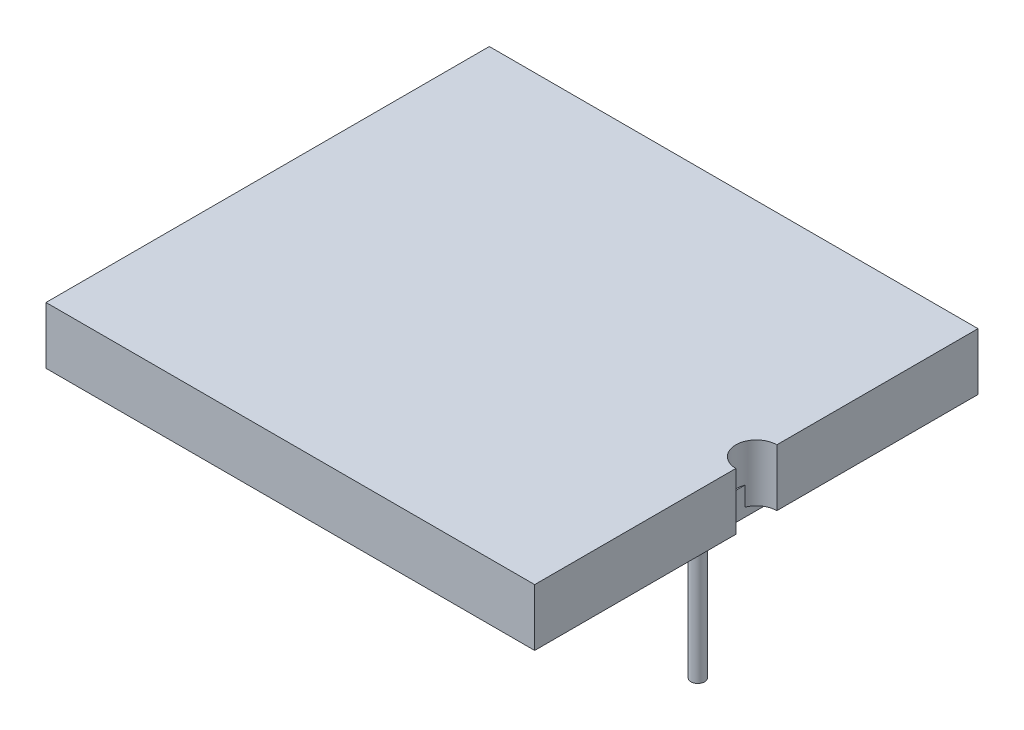
ISO-10303-21;
HEADER;
FILE_DESCRIPTION(('STEP AP214'),'2;1');
FILE_NAME('part.step','',(''),(''),'','','');
FILE_SCHEMA(('AUTOMOTIVE_DESIGN { 1 0 10303 214 1 1 1 1 }'));
ENDSEC;
DATA;
#1=APPLICATION_CONTEXT('core data for automotive mechanical design processes');
#2=APPLICATION_PROTOCOL_DEFINITION('international standard','automotive_design',2000,#1);
#3=PRODUCT_CONTEXT('',#1,'mechanical');
#4=PRODUCT('Part','Part','',(#3));
#5=PRODUCT_RELATED_PRODUCT_CATEGORY('part','',(#4));
#6=PRODUCT_DEFINITION_FORMATION('','',#4);
#7=PRODUCT_DEFINITION_CONTEXT('part definition',#1,'design');
#8=PRODUCT_DEFINITION('design','',#6,#7);
#9=PRODUCT_DEFINITION_SHAPE('','',#8);
#10=(LENGTH_UNIT() NAMED_UNIT(*) SI_UNIT(.MILLI.,.METRE.));
#11=(NAMED_UNIT(*) PLANE_ANGLE_UNIT() SI_UNIT($,.RADIAN.));
#12=(NAMED_UNIT(*) SI_UNIT($,.STERADIAN.) SOLID_ANGLE_UNIT());
#13=UNCERTAINTY_MEASURE_WITH_UNIT(LENGTH_MEASURE(1.E-05),#10,'distance_accuracy_value','');
#14=(GEOMETRIC_REPRESENTATION_CONTEXT(3) GLOBAL_UNCERTAINTY_ASSIGNED_CONTEXT((#13)) GLOBAL_UNIT_ASSIGNED_CONTEXT((#10,
#11,#12)) REPRESENTATION_CONTEXT('',''));
#15=CARTESIAN_POINT('',(0.,0.,0.));
#16=DIRECTION('',(0.,0.,1.));
#17=DIRECTION('',(1.,0.,0.));
#18=AXIS2_PLACEMENT_3D('',#15,#16,#17);
#19=CARTESIAN_POINT('',(6.35,-0.64130000972746,0.));
#20=DIRECTION('',(0.,-1.,0.));
#21=DIRECTION('',(0.,0.,-1.));
#22=AXIS2_PLACEMENT_3D('',#19,#20,#21);
#23=CYLINDRICAL_SURFACE('',#22,0.232885614944613);
#24=CARTESIAN_POINT('',(6.35,-1.3,0.));
#25=DIRECTION('',(0.,-1.,0.));
#26=DIRECTION('',(0.,0.,-1.));
#27=AXIS2_PLACEMENT_3D('',#24,#25,#26);
#28=CIRCLE('',#27,0.232885614944613);
#29=CARTESIAN_POINT('',(6.35,-1.3,-0.232885614944613));
#30=VERTEX_POINT('',#29);
#31=EDGE_CURVE('E11',#30,#30,#28,.F.);
#32=ORIENTED_EDGE('',*,*,#31,.F.);
#33=EDGE_LOOP('',(#32));
#34=FACE_BOUND('',#33,.T.);
#35=CARTESIAN_POINT('',(6.35,-7.55,0.));
#36=DIRECTION('',(0.,-1.,0.));
#37=DIRECTION('',(0.,0.,1.));
#38=AXIS2_PLACEMENT_3D('',#35,#36,#37);
#39=CIRCLE('',#38,0.232885614944613);
#40=CARTESIAN_POINT('',(6.35,-7.55,0.232885614944613));
#41=VERTEX_POINT('',#40);
#42=EDGE_CURVE('E47',#41,#41,#39,.T.);
#43=ORIENTED_EDGE('',*,*,#42,.F.);
#44=EDGE_LOOP('',(#43));
#45=FACE_BOUND('',#44,.T.);
#46=ADVANCED_FACE('F41',(#34,#45),#23,.T.);
#47=CARTESIAN_POINT('',(-5.,-1.3,-5.));
#48=DIRECTION('',(0.,-1.,0.));
#49=DIRECTION('',(0.,0.,-1.));
#50=AXIS2_PLACEMENT_3D('',#47,#48,#49);
#51=PLANE('',#50);
#52=ORIENTED_EDGE('',*,*,#31,.T.);
#53=EDGE_LOOP('',(#52));
#54=FACE_BOUND('',#53,.T.);
#55=ADVANCED_FACE('F56',(#54),#51,.F.);
#56=CARTESIAN_POINT('',(6.35,-7.55,0.));
#57=DIRECTION('',(0.,1.,0.));
#58=DIRECTION('',(0.,0.,1.));
#59=AXIS2_PLACEMENT_3D('',#56,#57,#58);
#60=PLANE('',#59);
#61=ORIENTED_EDGE('',*,*,#42,.T.);
#62=EDGE_LOOP('',(#61));
#63=FACE_BOUND('',#62,.T.);
#64=ADVANCED_FACE('F53',(#63),#60,.F.);
#65=CLOSED_SHELL('',(#46,#55,#64));
#66=MANIFOLD_SOLID_BREP('B2',#65);
#67=CARTESIAN_POINT('',(-6.35,-0.64130000972746,0.));
#68=DIRECTION('',(0.,-1.,0.));
#69=DIRECTION('',(0.,0.,-1.));
#70=AXIS2_PLACEMENT_3D('',#67,#68,#69);
#71=CYLINDRICAL_SURFACE('',#70,0.232885614944613);
#72=CARTESIAN_POINT('',(-6.35,-1.3,0.));
#73=DIRECTION('',(0.,-1.,0.));
#74=DIRECTION('',(0.,0.,-1.));
#75=AXIS2_PLACEMENT_3D('',#72,#73,#74);
#76=CIRCLE('',#75,0.232885614944613);
#77=CARTESIAN_POINT('',(-6.35,-1.3,-0.232885614944613));
#78=VERTEX_POINT('',#77);
#79=EDGE_CURVE('E40',#78,#78,#76,.F.);
#80=ORIENTED_EDGE('',*,*,#79,.F.);
#81=EDGE_LOOP('',(#80));
#82=FACE_BOUND('',#81,.T.);
#83=CARTESIAN_POINT('',(-6.35,-7.55,0.));
#84=DIRECTION('',(0.,-1.,0.));
#85=DIRECTION('',(0.,0.,-1.));
#86=AXIS2_PLACEMENT_3D('',#83,#84,#85);
#87=CIRCLE('',#86,0.232885614944613);
#88=CARTESIAN_POINT('',(-6.35,-7.55,-0.232885614944613));
#89=VERTEX_POINT('',#88);
#90=EDGE_CURVE('E97',#89,#89,#87,.T.);
#91=ORIENTED_EDGE('',*,*,#90,.F.);
#92=EDGE_LOOP('',(#91));
#93=FACE_BOUND('',#92,.T.);
#94=ADVANCED_FACE('F91',(#82,#93),#71,.T.);
#95=CARTESIAN_POINT('',(-5.,-1.3,-5.));
#96=DIRECTION('',(0.,-1.,0.));
#97=DIRECTION('',(0.,0.,-1.));
#98=AXIS2_PLACEMENT_3D('',#95,#96,#97);
#99=PLANE('',#98);
#100=ORIENTED_EDGE('',*,*,#79,.T.);
#101=EDGE_LOOP('',(#100));
#102=FACE_BOUND('',#101,.T.);
#103=ADVANCED_FACE('F106',(#102),#99,.F.);
#104=CARTESIAN_POINT('',(-6.35,-7.55,0.));
#105=DIRECTION('',(0.,-1.,0.));
#106=DIRECTION('',(0.,0.,-1.));
#107=AXIS2_PLACEMENT_3D('',#104,#105,#106);
#108=PLANE('',#107);
#109=ORIENTED_EDGE('',*,*,#90,.T.);
#110=EDGE_LOOP('',(#109));
#111=FACE_BOUND('',#110,.T.);
#112=ADVANCED_FACE('F103',(#111),#108,.T.);
#113=CLOSED_SHELL('',(#94,#103,#112));
#114=MANIFOLD_SOLID_BREP('B6',#113);
#115=CARTESIAN_POINT('',(-7.7,-2.25,7.));
#116=DIRECTION('',(0.,-1.,0.));
#117=DIRECTION('',(0.,0.,-1.));
#118=AXIS2_PLACEMENT_3D('',#115,#116,#117);
#119=PLANE('',#118);
#120=CARTESIAN_POINT('',(-6.35,-2.25,0.));
#121=DIRECTION('',(0.,-1.,0.));
#122=DIRECTION('',(0.,0.,-1.));
#123=AXIS2_PLACEMENT_3D('',#120,#121,#122);
#124=CIRCLE('',#123,0.500000000000001);
#125=CARTESIAN_POINT('',(-6.35,-2.25,-0.500000000000001));
#126=VERTEX_POINT('',#125);
#127=EDGE_CURVE('E200',#126,#126,#124,.T.);
#128=ORIENTED_EDGE('',*,*,#127,.F.);
#129=EDGE_LOOP('',(#128));
#130=FACE_BOUND('',#129,.T.);
#131=DIRECTION('',(0.,0.,-1.));
#132=VECTOR('',#131,1.);
#133=CARTESIAN_POINT('',(-7.7,-2.25,-7.));
#134=LINE('',#133,#132);
#135=CARTESIAN_POINT('',(-7.7,-2.25,7.));
#136=VERTEX_POINT('',#135);
#137=CARTESIAN_POINT('',(-7.7,-2.25,-7.));
#138=VERTEX_POINT('',#137);
#139=EDGE_CURVE('E181',#136,#138,#134,.T.);
#140=ORIENTED_EDGE('',*,*,#139,.T.);
#141=DIRECTION('',(1.,0.,0.));
#142=VECTOR('',#141,1.);
#143=CARTESIAN_POINT('',(7.7,-2.25,-7.));
#144=LINE('',#143,#142);
#145=CARTESIAN_POINT('',(7.7,-2.25,-7.));
#146=VERTEX_POINT('',#145);
#147=EDGE_CURVE('E186',#138,#146,#144,.T.);
#148=ORIENTED_EDGE('',*,*,#147,.T.);
#149=DIRECTION('',(0.,0.,1.));
#150=VECTOR('',#149,1.);
#151=CARTESIAN_POINT('',(7.7,-2.25,-7.));
#152=LINE('',#151,#150);
#153=CARTESIAN_POINT('',(7.7,-2.25,7.));
#154=VERTEX_POINT('',#153);
#155=EDGE_CURVE('E192',#146,#154,#152,.T.);
#156=ORIENTED_EDGE('',*,*,#155,.T.);
#157=DIRECTION('',(-1.,0.,0.));
#158=VECTOR('',#157,1.);
#159=CARTESIAN_POINT('',(7.7,-2.25,7.));
#160=LINE('',#159,#158);
#161=EDGE_CURVE('E184',#154,#136,#160,.T.);
#162=ORIENTED_EDGE('',*,*,#161,.T.);
#163=EDGE_LOOP('',(#140,#148,#156,#162));
#164=FACE_BOUND('',#163,.T.);
#165=CARTESIAN_POINT('',(6.35,-2.25,0.));
#166=DIRECTION('',(0.,-1.,0.));
#167=DIRECTION('',(0.,0.,1.));
#168=AXIS2_PLACEMENT_3D('',#165,#166,#167);
#169=CIRCLE('',#168,0.500000000000001);
#170=CARTESIAN_POINT('',(6.35,-2.25,0.500000000000001));
#171=VERTEX_POINT('',#170);
#172=EDGE_CURVE('E257',#171,#171,#169,.T.);
#173=ORIENTED_EDGE('',*,*,#172,.F.);
#174=EDGE_LOOP('',(#173));
#175=FACE_BOUND('',#174,.T.);
#176=ADVANCED_FACE('F142',(#130,#164,#175),#119,.T.);
#177=CARTESIAN_POINT('',(-7.7,19.9124962462459,-7.));
#178=DIRECTION('',(-1.,0.,0.));
#179=DIRECTION('',(0.,0.,1.));
#180=AXIS2_PLACEMENT_3D('',#177,#178,#179);
#181=PLANE('',#180);
#182=DIRECTION('',(0.,0.,1.));
#183=VECTOR('',#182,1.);
#184=CARTESIAN_POINT('',(-7.7,-1.3,-7.));
#185=LINE('',#184,#183);
#186=CARTESIAN_POINT('',(-7.7,-1.3,-7.));
#187=VERTEX_POINT('',#186);
#188=CARTESIAN_POINT('',(-7.7,-1.3,7.));
#189=VERTEX_POINT('',#188);
#190=EDGE_CURVE('E151',#187,#189,#185,.T.);
#191=ORIENTED_EDGE('',*,*,#190,.F.);
#192=DIRECTION('',(0.,-1.,0.));
#193=VECTOR('',#192,1.);
#194=CARTESIAN_POINT('',(-7.7,19.9124962462459,-7.));
#195=LINE('',#194,#193);
#196=EDGE_CURVE('E177',#187,#138,#195,.T.);
#197=ORIENTED_EDGE('',*,*,#196,.T.);
#198=ORIENTED_EDGE('',*,*,#139,.F.);
#199=DIRECTION('',(0.,-1.,0.));
#200=VECTOR('',#199,1.);
#201=CARTESIAN_POINT('',(-7.7,19.9124962462459,7.));
#202=LINE('',#201,#200);
#203=EDGE_CURVE('E209',#189,#136,#202,.T.);
#204=ORIENTED_EDGE('',*,*,#203,.F.);
#205=EDGE_LOOP('',(#191,#197,#198,#204));
#206=FACE_BOUND('',#205,.T.);
#207=ADVANCED_FACE('F144',(#206),#181,.T.);
#208=CARTESIAN_POINT('',(7.7,19.9124962462459,7.));
#209=DIRECTION('',(0.,0.,1.));
#210=DIRECTION('',(1.,0.,0.));
#211=AXIS2_PLACEMENT_3D('',#208,#209,#210);
#212=PLANE('',#211);
#213=DIRECTION('',(1.,0.,0.));
#214=VECTOR('',#213,1.);
#215=CARTESIAN_POINT('',(7.7,-1.3,7.));
#216=LINE('',#215,#214);
#217=CARTESIAN_POINT('',(7.7,-1.3,7.));
#218=VERTEX_POINT('',#217);
#219=EDGE_CURVE('E208',#189,#218,#216,.T.);
#220=ORIENTED_EDGE('',*,*,#219,.F.);
#221=ORIENTED_EDGE('',*,*,#203,.T.);
#222=ORIENTED_EDGE('',*,*,#161,.F.);
#223=DIRECTION('',(0.,-1.,0.));
#224=VECTOR('',#223,1.);
#225=CARTESIAN_POINT('',(7.7,19.9124962462459,7.));
#226=LINE('',#225,#224);
#227=EDGE_CURVE('E213',#218,#154,#226,.T.);
#228=ORIENTED_EDGE('',*,*,#227,.F.);
#229=EDGE_LOOP('',(#220,#221,#222,#228));
#230=FACE_BOUND('',#229,.T.);
#231=ADVANCED_FACE('F221',(#230),#212,.T.);
#232=CARTESIAN_POINT('',(7.7,19.9124962462459,-7.));
#233=DIRECTION('',(1.,0.,0.));
#234=DIRECTION('',(0.,0.,-1.));
#235=AXIS2_PLACEMENT_3D('',#232,#233,#234);
#236=PLANE('',#235);
#237=DIRECTION('',(0.,0.,-1.));
#238=VECTOR('',#237,1.);
#239=CARTESIAN_POINT('',(7.7,-1.3,-7.));
#240=LINE('',#239,#238);
#241=CARTESIAN_POINT('',(7.7,-1.3,-7.));
#242=VERTEX_POINT('',#241);
#243=EDGE_CURVE('E206',#218,#242,#240,.T.);
#244=ORIENTED_EDGE('',*,*,#243,.F.);
#245=ORIENTED_EDGE('',*,*,#227,.T.);
#246=ORIENTED_EDGE('',*,*,#155,.F.);
#247=DIRECTION('',(0.,-1.,0.));
#248=VECTOR('',#247,1.);
#249=CARTESIAN_POINT('',(7.7,19.9124962462459,-7.));
#250=LINE('',#249,#248);
#251=EDGE_CURVE('E183',#242,#146,#250,.T.);
#252=ORIENTED_EDGE('',*,*,#251,.F.);
#253=EDGE_LOOP('',(#244,#245,#246,#252));
#254=FACE_BOUND('',#253,.T.);
#255=ADVANCED_FACE('F218',(#254),#236,.T.);
#256=CARTESIAN_POINT('',(7.7,19.9124962462459,-7.));
#257=DIRECTION('',(0.,0.,-1.));
#258=DIRECTION('',(-1.,0.,0.));
#259=AXIS2_PLACEMENT_3D('',#256,#257,#258);
#260=PLANE('',#259);
#261=DIRECTION('',(-1.,0.,0.));
#262=VECTOR('',#261,1.);
#263=CARTESIAN_POINT('',(7.7,-1.3,-7.));
#264=LINE('',#263,#262);
#265=EDGE_CURVE('E89',#242,#187,#264,.T.);
#266=ORIENTED_EDGE('',*,*,#265,.F.);
#267=ORIENTED_EDGE('',*,*,#251,.T.);
#268=ORIENTED_EDGE('',*,*,#147,.F.);
#269=ORIENTED_EDGE('',*,*,#196,.F.);
#270=EDGE_LOOP('',(#266,#267,#268,#269));
#271=FACE_BOUND('',#270,.T.);
#272=ADVANCED_FACE('F187',(#271),#260,.T.);
#273=CARTESIAN_POINT('',(-5.,-1.3,-5.));
#274=DIRECTION('',(0.,-1.,0.));
#275=DIRECTION('',(0.,0.,-1.));
#276=AXIS2_PLACEMENT_3D('',#273,#274,#275);
#277=PLANE('',#276);
#278=ORIENTED_EDGE('',*,*,#190,.T.);
#279=ORIENTED_EDGE('',*,*,#219,.T.);
#280=ORIENTED_EDGE('',*,*,#243,.T.);
#281=ORIENTED_EDGE('',*,*,#265,.T.);
#282=EDGE_LOOP('',(#278,#279,#280,#281));
#283=FACE_BOUND('',#282,.T.);
#284=ADVANCED_FACE('F222',(#283),#277,.F.);
#285=CARTESIAN_POINT('',(-6.35,-2.25,0.));
#286=DIRECTION('',(0.,1.,0.));
#287=DIRECTION('',(0.,0.,-1.));
#288=AXIS2_PLACEMENT_3D('',#285,#286,#287);
#289=CONICAL_SURFACE('',#288,0.500000000000001,0.715584993317677);
#290=CARTESIAN_POINT('',(-6.35,-2.55,0.));
#291=DIRECTION('',(0.,-1.,0.));
#292=DIRECTION('',(0.,0.,-1.));
#293=AXIS2_PLACEMENT_3D('',#290,#291,#292);
#294=CIRCLE('',#293,0.239213978655132);
#295=CARTESIAN_POINT('',(-6.35,-2.55,-0.239213978655132));
#296=VERTEX_POINT('',#295);
#297=EDGE_CURVE('E197',#296,#296,#294,.T.);
#298=ORIENTED_EDGE('',*,*,#297,.F.);
#299=EDGE_LOOP('',(#298));
#300=FACE_BOUND('',#299,.T.);
#301=ORIENTED_EDGE('',*,*,#127,.T.);
#302=EDGE_LOOP('',(#301));
#303=FACE_BOUND('',#302,.T.);
#304=ADVANCED_FACE('F224',(#300,#303),#289,.T.);
#305=CARTESIAN_POINT('',(-6.35,-2.55,0.));
#306=DIRECTION('',(0.,-1.,0.));
#307=DIRECTION('',(0.,0.,-1.));
#308=AXIS2_PLACEMENT_3D('',#305,#306,#307);
#309=PLANE('',#308);
#310=ORIENTED_EDGE('',*,*,#297,.T.);
#311=EDGE_LOOP('',(#310));
#312=FACE_BOUND('',#311,.T.);
#313=ADVANCED_FACE('F230',(#312),#309,.T.);
#314=CARTESIAN_POINT('',(6.35,-2.25,0.));
#315=DIRECTION('',(0.,1.,0.));
#316=DIRECTION('',(0.,0.,1.));
#317=AXIS2_PLACEMENT_3D('',#314,#315,#316);
#318=CONICAL_SURFACE('',#317,0.500000000000001,0.715584993317677);
#319=CARTESIAN_POINT('',(6.35,-2.55,0.));
#320=DIRECTION('',(0.,1.,0.));
#321=DIRECTION('',(0.,0.,1.));
#322=AXIS2_PLACEMENT_3D('',#319,#320,#321);
#323=CIRCLE('',#322,0.239213978655132);
#324=CARTESIAN_POINT('',(6.35,-2.55,0.239213978655132));
#325=VERTEX_POINT('',#324);
#326=EDGE_CURVE('E256',#325,#325,#323,.F.);
#327=ORIENTED_EDGE('',*,*,#326,.F.);
#328=EDGE_LOOP('',(#327));
#329=FACE_BOUND('',#328,.T.);
#330=ORIENTED_EDGE('',*,*,#172,.T.);
#331=EDGE_LOOP('',(#330));
#332=FACE_BOUND('',#331,.T.);
#333=ADVANCED_FACE('F244',(#329,#332),#318,.T.);
#334=CARTESIAN_POINT('',(6.35,-2.55,0.));
#335=DIRECTION('',(0.,1.,0.));
#336=DIRECTION('',(0.,0.,1.));
#337=AXIS2_PLACEMENT_3D('',#334,#335,#336);
#338=PLANE('',#337);
#339=ORIENTED_EDGE('',*,*,#326,.T.);
#340=EDGE_LOOP('',(#339));
#341=FACE_BOUND('',#340,.T.);
#342=ADVANCED_FACE('F248',(#341),#338,.F.);
#343=CLOSED_SHELL('',(#176,#207,#231,#255,#272,#284,#304,#313,#333,#342));
#344=MANIFOLD_SOLID_BREP('B35',#343);
#345=CARTESIAN_POINT('',(-5.,-0.9,0.));
#346=DIRECTION('',(-1.,0.,0.));
#347=DIRECTION('',(0.,0.,1.));
#348=AXIS2_PLACEMENT_3D('',#345,#346,#347);
#349=PLANE('',#348);
#350=DIRECTION('',(0.,0.,-1.));
#351=VECTOR('',#350,1.);
#352=CARTESIAN_POINT('',(-5.,-1.95,0.));
#353=LINE('',#352,#351);
#354=CARTESIAN_POINT('',(-5.,-1.95,5.));
#355=VERTEX_POINT('',#354);
#356=CARTESIAN_POINT('',(-5.,-1.95,-5.));
#357=VERTEX_POINT('',#356);
#358=EDGE_CURVE('E403',#355,#357,#353,.T.);
#359=ORIENTED_EDGE('',*,*,#358,.F.);
#360=DIRECTION('',(0.,-1.,0.));
#361=VECTOR('',#360,1.);
#362=CARTESIAN_POINT('',(-5.,-0.9,5.));
#363=LINE('',#362,#361);
#364=CARTESIAN_POINT('',(-5.,-0.9,5.));
#365=VERTEX_POINT('',#364);
#366=EDGE_CURVE('E140',#365,#355,#363,.T.);
#367=ORIENTED_EDGE('',*,*,#366,.F.);
#368=DIRECTION('',(0.,0.,-1.));
#369=VECTOR('',#368,1.);
#370=CARTESIAN_POINT('',(-5.,-0.9,0.));
#371=LINE('',#370,#369);
#372=CARTESIAN_POINT('',(-5.,-0.9,-5.));
#373=VERTEX_POINT('',#372);
#374=EDGE_CURVE('E397',#365,#373,#371,.T.);
#375=ORIENTED_EDGE('',*,*,#374,.T.);
#376=DIRECTION('',(0.,-1.,0.));
#377=VECTOR('',#376,1.);
#378=CARTESIAN_POINT('',(-5.,-0.9,-5.));
#379=LINE('',#378,#377);
#380=EDGE_CURVE('E342',#373,#357,#379,.T.);
#381=ORIENTED_EDGE('',*,*,#380,.T.);
#382=EDGE_LOOP('',(#359,#367,#375,#381));
#383=FACE_BOUND('',#382,.T.);
#384=ADVANCED_FACE('F339',(#383),#349,.T.);
#385=CARTESIAN_POINT('',(8.35,-0.9,5.));
#386=DIRECTION('',(0.,0.,1.));
#387=DIRECTION('',(1.,0.,0.));
#388=AXIS2_PLACEMENT_3D('',#385,#386,#387);
#389=PLANE('',#388);
#390=DIRECTION('',(-1.,0.,0.));
#391=VECTOR('',#390,1.);
#392=CARTESIAN_POINT('',(8.35,-1.95,5.));
#393=LINE('',#392,#391);
#394=CARTESIAN_POINT('',(5.,-1.95,5.));
#395=VERTEX_POINT('',#394);
#396=EDGE_CURVE('E399',#395,#355,#393,.T.);
#397=ORIENTED_EDGE('',*,*,#396,.F.);
#398=DIRECTION('',(0.,-1.,0.));
#399=VECTOR('',#398,1.);
#400=CARTESIAN_POINT('',(5.,-0.9,5.));
#401=LINE('',#400,#399);
#402=CARTESIAN_POINT('',(5.,-0.9,5.));
#403=VERTEX_POINT('',#402);
#404=EDGE_CURVE('E348',#403,#395,#401,.T.);
#405=ORIENTED_EDGE('',*,*,#404,.F.);
#406=DIRECTION('',(-1.,0.,0.));
#407=VECTOR('',#406,1.);
#408=CARTESIAN_POINT('',(8.35,-0.9,5.));
#409=LINE('',#408,#407);
#410=EDGE_CURVE('E394',#403,#365,#409,.T.);
#411=ORIENTED_EDGE('',*,*,#410,.T.);
#412=ORIENTED_EDGE('',*,*,#366,.T.);
#413=EDGE_LOOP('',(#397,#405,#411,#412));
#414=FACE_BOUND('',#413,.T.);
#415=ADVANCED_FACE('F413',(#414),#389,.T.);
#416=CARTESIAN_POINT('',(5.,-0.9,0.));
#417=DIRECTION('',(1.,0.,0.));
#418=DIRECTION('',(0.,0.,-1.));
#419=AXIS2_PLACEMENT_3D('',#416,#417,#418);
#420=PLANE('',#419);
#421=DIRECTION('',(0.,0.,1.));
#422=VECTOR('',#421,1.);
#423=CARTESIAN_POINT('',(5.,-1.95,0.));
#424=LINE('',#423,#422);
#425=CARTESIAN_POINT('',(5.,-1.95,-5.));
#426=VERTEX_POINT('',#425);
#427=EDGE_CURVE('E389',#426,#395,#424,.T.);
#428=ORIENTED_EDGE('',*,*,#427,.F.);
#429=DIRECTION('',(0.,-1.,0.));
#430=VECTOR('',#429,1.);
#431=CARTESIAN_POINT('',(5.,-0.9,-5.));
#432=LINE('',#431,#430);
#433=CARTESIAN_POINT('',(5.,-0.9,-5.));
#434=VERTEX_POINT('',#433);
#435=EDGE_CURVE('E384',#434,#426,#432,.T.);
#436=ORIENTED_EDGE('',*,*,#435,.F.);
#437=DIRECTION('',(0.,0.,1.));
#438=VECTOR('',#437,1.);
#439=CARTESIAN_POINT('',(5.,-0.9,0.));
#440=LINE('',#439,#438);
#441=EDGE_CURVE('E387',#434,#403,#440,.T.);
#442=ORIENTED_EDGE('',*,*,#441,.T.);
#443=ORIENTED_EDGE('',*,*,#404,.T.);
#444=EDGE_LOOP('',(#428,#436,#442,#443));
#445=FACE_BOUND('',#444,.T.);
#446=ADVANCED_FACE('F386',(#445),#420,.T.);
#447=CARTESIAN_POINT('',(8.35,-0.9,-5.));
#448=DIRECTION('',(0.,0.,-1.));
#449=DIRECTION('',(-1.,0.,0.));
#450=AXIS2_PLACEMENT_3D('',#447,#448,#449);
#451=PLANE('',#450);
#452=DIRECTION('',(1.,0.,0.));
#453=VECTOR('',#452,1.);
#454=CARTESIAN_POINT('',(8.35,-1.95,-5.));
#455=LINE('',#454,#453);
#456=EDGE_CURVE('E406',#357,#426,#455,.T.);
#457=ORIENTED_EDGE('',*,*,#456,.F.);
#458=ORIENTED_EDGE('',*,*,#380,.F.);
#459=DIRECTION('',(1.,0.,0.));
#460=VECTOR('',#459,1.);
#461=CARTESIAN_POINT('',(8.35,-0.9,-5.));
#462=LINE('',#461,#460);
#463=EDGE_CURVE('E393',#373,#434,#462,.T.);
#464=ORIENTED_EDGE('',*,*,#463,.T.);
#465=ORIENTED_EDGE('',*,*,#435,.T.);
#466=EDGE_LOOP('',(#457,#458,#464,#465));
#467=FACE_BOUND('',#466,.T.);
#468=ADVANCED_FACE('F396',(#467),#451,.T.);
#469=CARTESIAN_POINT('',(-5.,-0.9,-5.));
#470=DIRECTION('',(0.,-1.,0.));
#471=DIRECTION('',(0.,0.,-1.));
#472=AXIS2_PLACEMENT_3D('',#469,#470,#471);
#473=PLANE('',#472);
#474=ORIENTED_EDGE('',*,*,#374,.F.);
#475=ORIENTED_EDGE('',*,*,#410,.F.);
#476=ORIENTED_EDGE('',*,*,#441,.F.);
#477=ORIENTED_EDGE('',*,*,#463,.F.);
#478=EDGE_LOOP('',(#474,#475,#476,#477));
#479=FACE_BOUND('',#478,.T.);
#480=ADVANCED_FACE('F392',(#479),#473,.F.);
#481=CARTESIAN_POINT('',(-5.,-1.95,-5.));
#482=DIRECTION('',(0.,-1.,0.));
#483=DIRECTION('',(0.,0.,-1.));
#484=AXIS2_PLACEMENT_3D('',#481,#482,#483);
#485=PLANE('',#484);
#486=ORIENTED_EDGE('',*,*,#358,.T.);
#487=ORIENTED_EDGE('',*,*,#456,.T.);
#488=ORIENTED_EDGE('',*,*,#427,.T.);
#489=ORIENTED_EDGE('',*,*,#396,.T.);
#490=EDGE_LOOP('',(#486,#487,#488,#489));
#491=FACE_BOUND('',#490,.T.);
#492=ADVANCED_FACE('F412',(#491),#485,.T.);
#493=CLOSED_SHELL('',(#384,#415,#446,#468,#480,#492));
#494=MANIFOLD_SOLID_BREP('B83',#493);
#495=CARTESIAN_POINT('',(-8.35,-1.95,-7.57499999999999));
#496=DIRECTION('',(-1.,0.,0.));
#497=DIRECTION('',(0.,0.,1.));
#498=AXIS2_PLACEMENT_3D('',#495,#496,#497);
#499=PLANE('',#498);
#500=DIRECTION('',(0.,0.,1.));
#501=VECTOR('',#500,1.);
#502=CARTESIAN_POINT('',(-8.35,0.,-7.57499999999999));
#503=LINE('',#502,#501);
#504=CARTESIAN_POINT('',(-8.35,0.,-7.57499999999999));
#505=VERTEX_POINT('',#504);
#506=CARTESIAN_POINT('',(-8.34999999999999,0.,7.57500000000001));
#507=VERTEX_POINT('',#506);
#508=EDGE_CURVE('E551',#505,#507,#503,.T.);
#509=ORIENTED_EDGE('',*,*,#508,.F.);
#510=DIRECTION('',(0.,1.,0.));
#511=VECTOR('',#510,1.);
#512=CARTESIAN_POINT('',(-8.35,-1.95,-7.57499999999999));
#513=LINE('',#512,#511);
#514=CARTESIAN_POINT('',(-8.35,-1.95,-7.57499999999999));
#515=VERTEX_POINT('',#514);
#516=EDGE_CURVE('E337',#515,#505,#513,.T.);
#517=ORIENTED_EDGE('',*,*,#516,.F.);
#518=DIRECTION('',(0.,0.,1.));
#519=VECTOR('',#518,1.);
#520=CARTESIAN_POINT('',(-8.35,-1.95,-7.57499999999999));
#521=LINE('',#520,#519);
#522=CARTESIAN_POINT('',(-8.34999999999999,-1.95,7.57500000000001));
#523=VERTEX_POINT('',#522);
#524=EDGE_CURVE('E565',#515,#523,#521,.T.);
#525=ORIENTED_EDGE('',*,*,#524,.T.);
#526=DIRECTION('',(0.,1.,0.));
#527=VECTOR('',#526,1.);
#528=CARTESIAN_POINT('',(-8.34999999999999,-1.95,7.57500000000001));
#529=LINE('',#528,#527);
#530=EDGE_CURVE('E469',#523,#507,#529,.T.);
#531=ORIENTED_EDGE('',*,*,#530,.T.);
#532=EDGE_LOOP('',(#509,#517,#525,#531));
#533=FACE_BOUND('',#532,.T.);
#534=ADVANCED_FACE('F466',(#533),#499,.T.);
#535=CARTESIAN_POINT('',(8.35,-1.95,-7.57499999999999));
#536=DIRECTION('',(0.,0.,-1.));
#537=DIRECTION('',(-1.,0.,0.));
#538=AXIS2_PLACEMENT_3D('',#535,#536,#537);
#539=PLANE('',#538);
#540=DIRECTION('',(-1.,0.,0.));
#541=VECTOR('',#540,1.);
#542=CARTESIAN_POINT('',(8.35,0.,-7.57499999999999));
#543=LINE('',#542,#541);
#544=CARTESIAN_POINT('',(8.35,0.,-7.57499999999999));
#545=VERTEX_POINT('',#544);
#546=EDGE_CURVE('E563',#545,#505,#543,.T.);
#547=ORIENTED_EDGE('',*,*,#546,.F.);
#548=DIRECTION('',(0.,1.,0.));
#549=VECTOR('',#548,1.);
#550=CARTESIAN_POINT('',(8.35,-1.95,-7.57499999999999));
#551=LINE('',#550,#549);
#552=CARTESIAN_POINT('',(8.35,-1.95,-7.57499999999999));
#553=VERTEX_POINT('',#552);
#554=EDGE_CURVE('E475',#553,#545,#551,.T.);
#555=ORIENTED_EDGE('',*,*,#554,.F.);
#556=DIRECTION('',(-1.,0.,0.));
#557=VECTOR('',#556,1.);
#558=CARTESIAN_POINT('',(8.35,-1.95,-7.57499999999999));
#559=LINE('',#558,#557);
#560=EDGE_CURVE('E541',#553,#515,#559,.T.);
#561=ORIENTED_EDGE('',*,*,#560,.T.);
#562=ORIENTED_EDGE('',*,*,#516,.T.);
#563=EDGE_LOOP('',(#547,#555,#561,#562));
#564=FACE_BOUND('',#563,.T.);
#565=ADVANCED_FACE('F573',(#564),#539,.T.);
#566=CARTESIAN_POINT('',(8.35,-1.95,-7.57499999999999));
#567=DIRECTION('',(1.,0.,0.));
#568=DIRECTION('',(0.,0.,-1.));
#569=AXIS2_PLACEMENT_3D('',#566,#567,#568);
#570=PLANE('',#569);
#571=DIRECTION('',(0.,0.,-1.));
#572=VECTOR('',#571,1.);
#573=CARTESIAN_POINT('',(8.35,0.,-7.57499999999999));
#574=LINE('',#573,#572);
#575=CARTESIAN_POINT('',(8.35,0.,-0.699999999999993));
#576=VERTEX_POINT('',#575);
#577=EDGE_CURVE('E528',#576,#545,#574,.T.);
#578=ORIENTED_EDGE('',*,*,#577,.F.);
#579=DIRECTION('',(0.,1.,0.));
#580=VECTOR('',#579,1.);
#581=CARTESIAN_POINT('',(8.35,-1.95,-0.699999999999993));
#582=LINE('',#581,#580);
#583=CARTESIAN_POINT('',(8.35,-1.95,-0.699999999999993));
#584=VERTEX_POINT('',#583);
#585=EDGE_CURVE('E523',#584,#576,#582,.T.);
#586=ORIENTED_EDGE('',*,*,#585,.F.);
#587=DIRECTION('',(0.,0.,-1.));
#588=VECTOR('',#587,1.);
#589=CARTESIAN_POINT('',(8.35,-1.95,-7.57499999999999));
#590=LINE('',#589,#588);
#591=EDGE_CURVE('E526',#584,#553,#590,.T.);
#592=ORIENTED_EDGE('',*,*,#591,.T.);
#593=ORIENTED_EDGE('',*,*,#554,.T.);
#594=EDGE_LOOP('',(#578,#586,#592,#593));
#595=FACE_BOUND('',#594,.T.);
#596=ADVANCED_FACE('F525',(#595),#570,.T.);
#597=CARTESIAN_POINT('',(8.35,-1.95,0.));
#598=DIRECTION('',(0.,1.,0.));
#599=DIRECTION('',(0.,0.,1.));
#600=AXIS2_PLACEMENT_3D('',#597,#598,#599);
#601=CYLINDRICAL_SURFACE('',#600,0.7);
#602=CARTESIAN_POINT('',(8.35,0.,0.));
#603=DIRECTION('',(0.,-1.,0.));
#604=DIRECTION('',(0.,0.,1.));
#605=AXIS2_PLACEMENT_3D('',#602,#603,#604);
#606=CIRCLE('',#605,0.7);
#607=CARTESIAN_POINT('',(8.35,0.,0.7));
#608=VERTEX_POINT('',#607);
#609=EDGE_CURVE('E560',#608,#576,#606,.T.);
#610=ORIENTED_EDGE('',*,*,#609,.F.);
#611=DIRECTION('',(0.,1.,0.));
#612=VECTOR('',#611,1.);
#613=CARTESIAN_POINT('',(8.35,-1.95,0.7));
#614=LINE('',#613,#612);
#615=CARTESIAN_POINT('',(8.35,-1.95,0.7));
#616=VERTEX_POINT('',#615);
#617=EDGE_CURVE('E533',#616,#608,#614,.T.);
#618=ORIENTED_EDGE('',*,*,#617,.F.);
#619=CARTESIAN_POINT('',(8.35,-1.95,0.));
#620=DIRECTION('',(0.,-1.,0.));
#621=DIRECTION('',(0.,0.,1.));
#622=AXIS2_PLACEMENT_3D('',#619,#620,#621);
#623=CIRCLE('',#622,0.7);
#624=EDGE_CURVE('E539',#616,#584,#623,.T.);
#625=ORIENTED_EDGE('',*,*,#624,.T.);
#626=ORIENTED_EDGE('',*,*,#585,.T.);
#627=EDGE_LOOP('',(#610,#618,#625,#626));
#628=FACE_BOUND('',#627,.T.);
#629=ADVANCED_FACE('F543',(#628),#601,.F.);
#630=CARTESIAN_POINT('',(8.35,-1.95,0.7));
#631=DIRECTION('',(1.,0.,0.));
#632=DIRECTION('',(0.,0.,-1.));
#633=AXIS2_PLACEMENT_3D('',#630,#631,#632);
#634=PLANE('',#633);
#635=DIRECTION('',(0.,0.,-1.));
#636=VECTOR('',#635,1.);
#637=CARTESIAN_POINT('',(8.35,0.,0.7));
#638=LINE('',#637,#636);
#639=CARTESIAN_POINT('',(8.35,0.,7.57500000000001));
#640=VERTEX_POINT('',#639);
#641=EDGE_CURVE('E557',#640,#608,#638,.T.);
#642=ORIENTED_EDGE('',*,*,#641,.F.);
#643=DIRECTION('',(0.,1.,0.));
#644=VECTOR('',#643,1.);
#645=CARTESIAN_POINT('',(8.35,-1.95,7.57500000000001));
#646=LINE('',#645,#644);
#647=CARTESIAN_POINT('',(8.35,-1.95,7.57500000000001));
#648=VERTEX_POINT('',#647);
#649=EDGE_CURVE('E568',#648,#640,#646,.T.);
#650=ORIENTED_EDGE('',*,*,#649,.F.);
#651=DIRECTION('',(0.,0.,-1.));
#652=VECTOR('',#651,1.);
#653=CARTESIAN_POINT('',(8.35,-1.95,0.7));
#654=LINE('',#653,#652);
#655=EDGE_CURVE('E544',#648,#616,#654,.T.);
#656=ORIENTED_EDGE('',*,*,#655,.T.);
#657=ORIENTED_EDGE('',*,*,#617,.T.);
#658=EDGE_LOOP('',(#642,#650,#656,#657));
#659=FACE_BOUND('',#658,.T.);
#660=ADVANCED_FACE('F586',(#659),#634,.T.);
#661=CARTESIAN_POINT('',(8.35,-1.95,7.57500000000001));
#662=DIRECTION('',(0.,0.,1.));
#663=DIRECTION('',(1.,0.,0.));
#664=AXIS2_PLACEMENT_3D('',#661,#662,#663);
#665=PLANE('',#664);
#666=DIRECTION('',(1.,0.,0.));
#667=VECTOR('',#666,1.);
#668=CARTESIAN_POINT('',(8.35,0.,7.57500000000001));
#669=LINE('',#668,#667);
#670=EDGE_CURVE('E554',#507,#640,#669,.T.);
#671=ORIENTED_EDGE('',*,*,#670,.F.);
#672=ORIENTED_EDGE('',*,*,#530,.F.);
#673=DIRECTION('',(1.,0.,0.));
#674=VECTOR('',#673,1.);
#675=CARTESIAN_POINT('',(8.35,-1.95,7.57500000000001));
#676=LINE('',#675,#674);
#677=EDGE_CURVE('E546',#523,#648,#676,.T.);
#678=ORIENTED_EDGE('',*,*,#677,.T.);
#679=ORIENTED_EDGE('',*,*,#649,.T.);
#680=EDGE_LOOP('',(#671,#672,#678,#679));
#681=FACE_BOUND('',#680,.T.);
#682=ADVANCED_FACE('F570',(#681),#665,.T.);
#683=CARTESIAN_POINT('',(8.35,-1.95,0.));
#684=DIRECTION('',(0.,1.,0.));
#685=DIRECTION('',(0.,0.,1.));
#686=AXIS2_PLACEMENT_3D('',#683,#684,#685);
#687=PLANE('',#686);
#688=ORIENTED_EDGE('',*,*,#524,.F.);
#689=ORIENTED_EDGE('',*,*,#560,.F.);
#690=ORIENTED_EDGE('',*,*,#591,.F.);
#691=ORIENTED_EDGE('',*,*,#624,.F.);
#692=ORIENTED_EDGE('',*,*,#655,.F.);
#693=ORIENTED_EDGE('',*,*,#677,.F.);
#694=EDGE_LOOP('',(#688,#689,#690,#691,#692,#693));
#695=FACE_BOUND('',#694,.T.);
#696=ADVANCED_FACE('F537',(#695),#687,.F.);
#697=CARTESIAN_POINT('',(8.35,0.,0.));
#698=DIRECTION('',(0.,1.,0.));
#699=DIRECTION('',(0.,0.,1.));
#700=AXIS2_PLACEMENT_3D('',#697,#698,#699);
#701=PLANE('',#700);
#702=ORIENTED_EDGE('',*,*,#508,.T.);
#703=ORIENTED_EDGE('',*,*,#670,.T.);
#704=ORIENTED_EDGE('',*,*,#641,.T.);
#705=ORIENTED_EDGE('',*,*,#609,.T.);
#706=ORIENTED_EDGE('',*,*,#577,.T.);
#707=ORIENTED_EDGE('',*,*,#546,.T.);
#708=EDGE_LOOP('',(#702,#703,#704,#705,#706,#707));
#709=FACE_BOUND('',#708,.T.);
#710=ADVANCED_FACE('F572',(#709),#701,.T.);
#711=CLOSED_SHELL('',(#534,#565,#596,#629,#660,#682,#696,#710));
#712=MANIFOLD_SOLID_BREP('B134',#711);
#713=ADVANCED_BREP_SHAPE_REPRESENTATION('',(#18,#66,#114,#344,#494,#712),#14);
#714=SHAPE_DEFINITION_REPRESENTATION(#9,#713);
ENDSEC;
END-ISO-10303-21;
